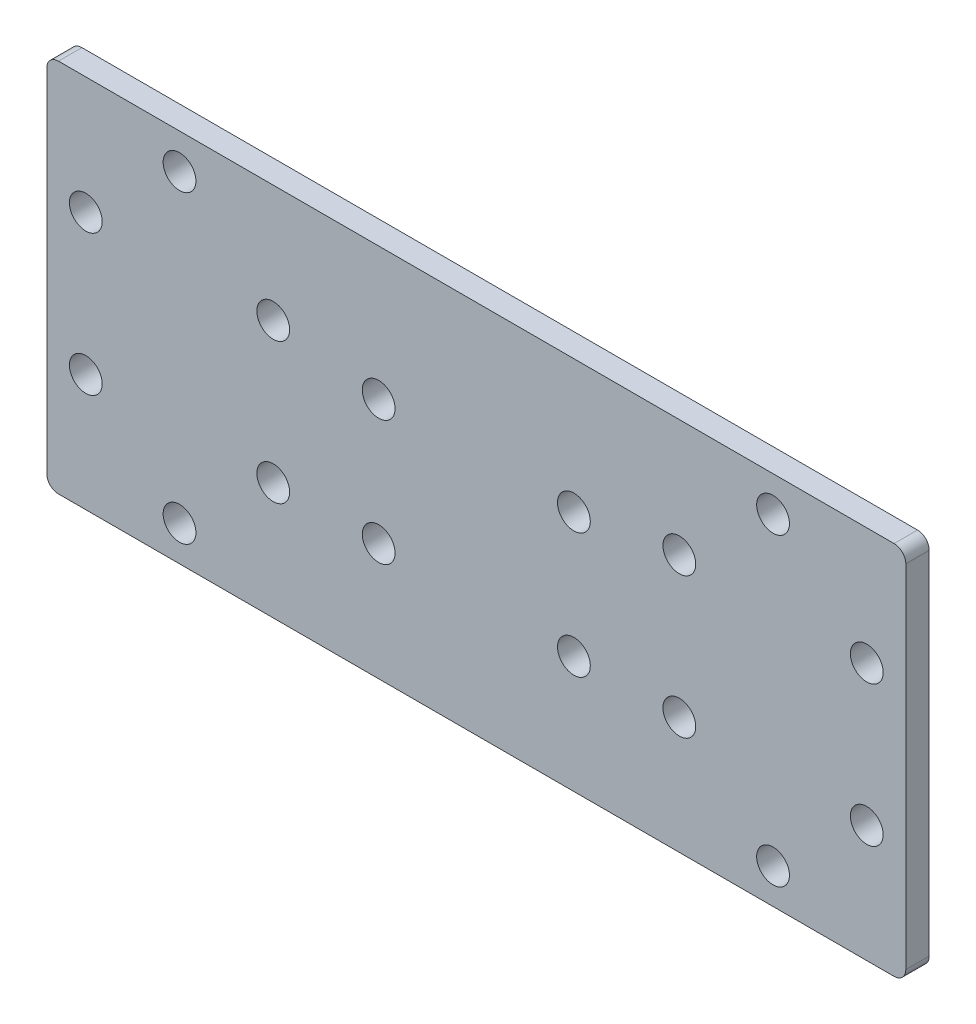
ISO-10303-21;
HEADER;
FILE_DESCRIPTION(('STEP AP214'),'2;1');
FILE_NAME('part.step','',(''),(''),'','','');
FILE_SCHEMA(('AUTOMOTIVE_DESIGN { 1 0 10303 214 1 1 1 1 }'));
ENDSEC;
DATA;
#1=APPLICATION_CONTEXT('core data for automotive mechanical design processes');
#2=APPLICATION_PROTOCOL_DEFINITION('international standard','automotive_design',2000,#1);
#3=PRODUCT_CONTEXT('',#1,'mechanical');
#4=PRODUCT('Part','Part','',(#3));
#5=PRODUCT_RELATED_PRODUCT_CATEGORY('part','',(#4));
#6=PRODUCT_DEFINITION_FORMATION('','',#4);
#7=PRODUCT_DEFINITION_CONTEXT('part definition',#1,'design');
#8=PRODUCT_DEFINITION('design','',#6,#7);
#9=PRODUCT_DEFINITION_SHAPE('','',#8);
#10=(LENGTH_UNIT() NAMED_UNIT(*) SI_UNIT(.MILLI.,.METRE.));
#11=(NAMED_UNIT(*) PLANE_ANGLE_UNIT() SI_UNIT($,.RADIAN.));
#12=(NAMED_UNIT(*) SI_UNIT($,.STERADIAN.) SOLID_ANGLE_UNIT());
#13=UNCERTAINTY_MEASURE_WITH_UNIT(LENGTH_MEASURE(1.E-05),#10,'distance_accuracy_value','');
#14=(GEOMETRIC_REPRESENTATION_CONTEXT(3) GLOBAL_UNCERTAINTY_ASSIGNED_CONTEXT((#13)) GLOBAL_UNIT_ASSIGNED_CONTEXT((#10,
#11,#12)) REPRESENTATION_CONTEXT('',''));
#15=CARTESIAN_POINT('',(0.,0.,0.));
#16=DIRECTION('',(0.,0.,1.));
#17=DIRECTION('',(1.,0.,0.));
#18=AXIS2_PLACEMENT_3D('',#15,#16,#17);
#19=CARTESIAN_POINT('',(0.,0.,1.5));
#20=DIRECTION('',(0.,0.,-1.));
#21=DIRECTION('',(-1.,0.,0.));
#22=AXIS2_PLACEMENT_3D('',#19,#20,#21);
#23=PLANE('',#22);
#24=DIRECTION('',(0.,-1.,0.));
#25=VECTOR('',#24,1.);
#26=CARTESIAN_POINT('',(-54.9999999999997,-24.0000000000009,1.5));
#27=LINE('',#26,#25);
#28=CARTESIAN_POINT('',(-54.9999999999997,22.4999999999991,1.5));
#29=VERTEX_POINT('',#28);
#30=CARTESIAN_POINT('',(-54.9999999999997,-22.5000000000009,1.5));
#31=VERTEX_POINT('',#30);
#32=EDGE_CURVE('E138',#29,#31,#27,.T.);
#33=ORIENTED_EDGE('',*,*,#32,.T.);
#34=CARTESIAN_POINT('',(-53.4999999999997,-22.5000000000009,1.5));
#35=DIRECTION('',(0.,0.,-1.));
#36=DIRECTION('',(-1.,0.,0.));
#37=AXIS2_PLACEMENT_3D('',#34,#35,#36);
#38=CIRCLE('',#37,1.5);
#39=CARTESIAN_POINT('',(-53.4999999999997,-24.0000000000009,1.5));
#40=VERTEX_POINT('',#39);
#41=EDGE_CURVE('E153',#31,#40,#38,.F.);
#42=ORIENTED_EDGE('',*,*,#41,.T.);
#43=DIRECTION('',(1.,0.,0.));
#44=VECTOR('',#43,1.);
#45=CARTESIAN_POINT('',(-54.9999999999997,-24.0000000000009,1.5));
#46=LINE('',#45,#44);
#47=CARTESIAN_POINT('',(53.4999999999988,-24.0000000000009,1.5));
#48=VERTEX_POINT('',#47);
#49=EDGE_CURVE('E120',#40,#48,#46,.T.);
#50=ORIENTED_EDGE('',*,*,#49,.T.);
#51=CARTESIAN_POINT('',(53.4999999999988,-22.5000000000009,1.5));
#52=DIRECTION('',(0.,0.,-1.));
#53=DIRECTION('',(-1.,0.,0.));
#54=AXIS2_PLACEMENT_3D('',#51,#52,#53);
#55=CIRCLE('',#54,1.5);
#56=CARTESIAN_POINT('',(54.9999999999988,-22.5000000000009,1.5));
#57=VERTEX_POINT('',#56);
#58=EDGE_CURVE('E151',#48,#57,#55,.F.);
#59=ORIENTED_EDGE('',*,*,#58,.T.);
#60=DIRECTION('',(0.,1.,0.));
#61=VECTOR('',#60,1.);
#62=CARTESIAN_POINT('',(54.9999999999988,23.9999999999991,1.5));
#63=LINE('',#62,#61);
#64=CARTESIAN_POINT('',(54.9999999999988,22.4999999999991,1.5));
#65=VERTEX_POINT('',#64);
#66=EDGE_CURVE('E164',#57,#65,#63,.T.);
#67=ORIENTED_EDGE('',*,*,#66,.T.);
#68=CARTESIAN_POINT('',(53.4999999999988,22.4999999999991,1.5));
#69=DIRECTION('',(0.,0.,-1.));
#70=DIRECTION('',(-1.,0.,0.));
#71=AXIS2_PLACEMENT_3D('',#68,#69,#70);
#72=CIRCLE('',#71,1.5);
#73=CARTESIAN_POINT('',(53.4999999999988,23.9999999999991,1.5));
#74=VERTEX_POINT('',#73);
#75=EDGE_CURVE('E55',#65,#74,#72,.F.);
#76=ORIENTED_EDGE('',*,*,#75,.T.);
#77=DIRECTION('',(-1.,0.,0.));
#78=VECTOR('',#77,1.);
#79=CARTESIAN_POINT('',(-54.9999999999997,23.9999999999991,1.5));
#80=LINE('',#79,#78);
#81=CARTESIAN_POINT('',(-53.4999999999997,23.9999999999991,1.5));
#82=VERTEX_POINT('',#81);
#83=EDGE_CURVE('E139',#74,#82,#80,.T.);
#84=ORIENTED_EDGE('',*,*,#83,.T.);
#85=CARTESIAN_POINT('',(-53.4999999999997,22.4999999999991,1.5));
#86=DIRECTION('',(0.,0.,-1.));
#87=DIRECTION('',(-1.,0.,0.));
#88=AXIS2_PLACEMENT_3D('',#85,#86,#87);
#89=CIRCLE('',#88,1.5);
#90=EDGE_CURVE('E148',#82,#29,#89,.F.);
#91=ORIENTED_EDGE('',*,*,#90,.T.);
#92=EDGE_LOOP('',(#33,#42,#50,#59,#67,#76,#84,#91));
#93=FACE_BOUND('',#92,.T.);
#94=CARTESIAN_POINT('',(49.999999999998,8.99999999999945,1.5));
#95=DIRECTION('',(0.,0.,1.));
#96=DIRECTION('',(1.,0.,0.));
#97=AXIS2_PLACEMENT_3D('',#94,#95,#96);
#98=CIRCLE('',#97,2.10000000000043);
#99=CARTESIAN_POINT('',(52.0999999999985,8.99999999999945,1.5));
#100=VERTEX_POINT('',#99);
#101=EDGE_CURVE('E133',#100,#100,#98,.T.);
#102=ORIENTED_EDGE('',*,*,#101,.F.);
#103=EDGE_LOOP('',(#102));
#104=FACE_BOUND('',#103,.T.);
#105=CARTESIAN_POINT('',(25.999999999998,8.99999999999945,1.5));
#106=DIRECTION('',(0.,0.,1.));
#107=DIRECTION('',(1.,0.,0.));
#108=AXIS2_PLACEMENT_3D('',#105,#106,#107);
#109=CIRCLE('',#108,2.10000000000044);
#110=CARTESIAN_POINT('',(28.0999999999985,8.99999999999945,1.5));
#111=VERTEX_POINT('',#110);
#112=EDGE_CURVE('E181',#111,#111,#109,.T.);
#113=ORIENTED_EDGE('',*,*,#112,.F.);
#114=EDGE_LOOP('',(#113));
#115=FACE_BOUND('',#114,.T.);
#116=CARTESIAN_POINT('',(49.999999999998,-9.00000000000034,1.5));
#117=DIRECTION('',(0.,0.,1.));
#118=DIRECTION('',(1.,0.,0.));
#119=AXIS2_PLACEMENT_3D('',#116,#117,#118);
#120=CIRCLE('',#119,2.10000000000043);
#121=CARTESIAN_POINT('',(52.0999999999985,-9.00000000000034,1.5));
#122=VERTEX_POINT('',#121);
#123=EDGE_CURVE('E187',#122,#122,#120,.T.);
#124=ORIENTED_EDGE('',*,*,#123,.F.);
#125=EDGE_LOOP('',(#124));
#126=FACE_BOUND('',#125,.T.);
#127=CARTESIAN_POINT('',(25.999999999998,-9.00000000000034,1.5));
#128=DIRECTION('',(0.,0.,1.));
#129=DIRECTION('',(1.,0.,0.));
#130=AXIS2_PLACEMENT_3D('',#127,#128,#129);
#131=CIRCLE('',#130,2.10000000000044);
#132=CARTESIAN_POINT('',(28.0999999999985,-9.00000000000034,1.5));
#133=VERTEX_POINT('',#132);
#134=EDGE_CURVE('E193',#133,#133,#131,.T.);
#135=ORIENTED_EDGE('',*,*,#134,.F.);
#136=EDGE_LOOP('',(#135));
#137=FACE_BOUND('',#136,.T.);
#138=CARTESIAN_POINT('',(-49.9999999999989,8.99999999999856,1.5));
#139=DIRECTION('',(0.,0.,1.));
#140=DIRECTION('',(1.,0.,0.));
#141=AXIS2_PLACEMENT_3D('',#138,#139,#140);
#142=CIRCLE('',#141,2.10000000000043);
#143=CARTESIAN_POINT('',(-47.8999999999985,8.99999999999856,1.5));
#144=VERTEX_POINT('',#143);
#145=EDGE_CURVE('E199',#144,#144,#142,.T.);
#146=ORIENTED_EDGE('',*,*,#145,.F.);
#147=EDGE_LOOP('',(#146));
#148=FACE_BOUND('',#147,.T.);
#149=CARTESIAN_POINT('',(-25.9999999999989,8.99999999999856,1.5));
#150=DIRECTION('',(0.,0.,1.));
#151=DIRECTION('',(1.,0.,0.));
#152=AXIS2_PLACEMENT_3D('',#149,#150,#151);
#153=CIRCLE('',#152,2.10000000000044);
#154=CARTESIAN_POINT('',(-23.8999999999985,8.99999999999856,1.5));
#155=VERTEX_POINT('',#154);
#156=EDGE_CURVE('E205',#155,#155,#153,.T.);
#157=ORIENTED_EDGE('',*,*,#156,.F.);
#158=EDGE_LOOP('',(#157));
#159=FACE_BOUND('',#158,.T.);
#160=CARTESIAN_POINT('',(-49.9999999999989,-9.00000000000123,1.5));
#161=DIRECTION('',(0.,0.,1.));
#162=DIRECTION('',(1.,0.,0.));
#163=AXIS2_PLACEMENT_3D('',#160,#161,#162);
#164=CIRCLE('',#163,2.10000000000043);
#165=CARTESIAN_POINT('',(-47.8999999999985,-9.00000000000123,1.5));
#166=VERTEX_POINT('',#165);
#167=EDGE_CURVE('E211',#166,#166,#164,.T.);
#168=ORIENTED_EDGE('',*,*,#167,.F.);
#169=EDGE_LOOP('',(#168));
#170=FACE_BOUND('',#169,.T.);
#171=CARTESIAN_POINT('',(-25.9999999999989,-9.00000000000034,1.5));
#172=DIRECTION('',(0.,0.,1.));
#173=DIRECTION('',(1.,0.,0.));
#174=AXIS2_PLACEMENT_3D('',#171,#172,#173);
#175=CIRCLE('',#174,2.10000000000044);
#176=CARTESIAN_POINT('',(-23.8999999999985,-9.00000000000034,1.5));
#177=VERTEX_POINT('',#176);
#178=EDGE_CURVE('E217',#177,#177,#175,.T.);
#179=ORIENTED_EDGE('',*,*,#178,.F.);
#180=EDGE_LOOP('',(#179));
#181=FACE_BOUND('',#180,.T.);
#182=CARTESIAN_POINT('',(-38.0000000000003,19.4999999999999,1.5));
#183=DIRECTION('',(0.,0.,1.));
#184=DIRECTION('',(1.,0.,0.));
#185=AXIS2_PLACEMENT_3D('',#182,#183,#184);
#186=CIRCLE('',#185,2.10000000000043);
#187=CARTESIAN_POINT('',(-35.8999999999998,19.4999999999999,1.5));
#188=VERTEX_POINT('',#187);
#189=EDGE_CURVE('E223',#188,#188,#186,.T.);
#190=ORIENTED_EDGE('',*,*,#189,.F.);
#191=EDGE_LOOP('',(#190));
#192=FACE_BOUND('',#191,.T.);
#193=CARTESIAN_POINT('',(-38.0000000000011,-19.5000000000025,1.5));
#194=DIRECTION('',(0.,0.,1.));
#195=DIRECTION('',(1.,0.,0.));
#196=AXIS2_PLACEMENT_3D('',#193,#194,#195);
#197=CIRCLE('',#196,2.10000000000043);
#198=CARTESIAN_POINT('',(-35.9000000000007,-19.5000000000025,1.5));
#199=VERTEX_POINT('',#198);
#200=EDGE_CURVE('E229',#199,#199,#197,.T.);
#201=ORIENTED_EDGE('',*,*,#200,.F.);
#202=EDGE_LOOP('',(#201));
#203=FACE_BOUND('',#202,.T.);
#204=CARTESIAN_POINT('',(38.0000000000003,19.4999999999999,1.5));
#205=DIRECTION('',(0.,0.,1.));
#206=DIRECTION('',(1.,0.,0.));
#207=AXIS2_PLACEMENT_3D('',#204,#205,#206);
#208=CIRCLE('',#207,2.10000000000043);
#209=CARTESIAN_POINT('',(40.1000000000007,19.4999999999999,1.5));
#210=VERTEX_POINT('',#209);
#211=EDGE_CURVE('E235',#210,#210,#208,.T.);
#212=ORIENTED_EDGE('',*,*,#211,.F.);
#213=EDGE_LOOP('',(#212));
#214=FACE_BOUND('',#213,.T.);
#215=CARTESIAN_POINT('',(38.0000000000011,-19.5000000000025,1.5));
#216=DIRECTION('',(0.,0.,1.));
#217=DIRECTION('',(1.,0.,0.));
#218=AXIS2_PLACEMENT_3D('',#215,#216,#217);
#219=CIRCLE('',#218,2.10000000000043);
#220=CARTESIAN_POINT('',(40.1000000000016,-19.5000000000025,1.5));
#221=VERTEX_POINT('',#220);
#222=EDGE_CURVE('E241',#221,#221,#219,.T.);
#223=ORIENTED_EDGE('',*,*,#222,.F.);
#224=EDGE_LOOP('',(#223));
#225=FACE_BOUND('',#224,.T.);
#226=CARTESIAN_POINT('',(12.4999999999993,-8.99999999999856,1.5));
#227=DIRECTION('',(0.,0.,1.));
#228=DIRECTION('',(1.,0.,0.));
#229=AXIS2_PLACEMENT_3D('',#226,#227,#228);
#230=CIRCLE('',#229,2.10000000000043);
#231=CARTESIAN_POINT('',(14.5999999999997,-8.99999999999856,1.5));
#232=VERTEX_POINT('',#231);
#233=EDGE_CURVE('E247',#232,#232,#230,.T.);
#234=ORIENTED_EDGE('',*,*,#233,.F.);
#235=EDGE_LOOP('',(#234));
#236=FACE_BOUND('',#235,.T.);
#237=CARTESIAN_POINT('',(-12.500000000002,-8.99999999999856,1.5));
#238=DIRECTION('',(0.,0.,1.));
#239=DIRECTION('',(1.,0.,0.));
#240=AXIS2_PLACEMENT_3D('',#237,#238,#239);
#241=CIRCLE('',#240,2.10000000000043);
#242=CARTESIAN_POINT('',(-10.4000000000015,-8.99999999999856,1.5));
#243=VERTEX_POINT('',#242);
#244=EDGE_CURVE('E253',#243,#243,#241,.T.);
#245=ORIENTED_EDGE('',*,*,#244,.F.);
#246=EDGE_LOOP('',(#245));
#247=FACE_BOUND('',#246,.T.);
#248=CARTESIAN_POINT('',(-12.500000000002,7.00000000000056,1.5));
#249=DIRECTION('',(0.,0.,1.));
#250=DIRECTION('',(1.,0.,0.));
#251=AXIS2_PLACEMENT_3D('',#248,#249,#250);
#252=CIRCLE('',#251,2.10000000000043);
#253=CARTESIAN_POINT('',(-10.4000000000015,7.00000000000056,1.5));
#254=VERTEX_POINT('',#253);
#255=EDGE_CURVE('E259',#254,#254,#252,.T.);
#256=ORIENTED_EDGE('',*,*,#255,.F.);
#257=EDGE_LOOP('',(#256));
#258=FACE_BOUND('',#257,.T.);
#259=CARTESIAN_POINT('',(12.4999999999993,7.00000000000145,1.5));
#260=DIRECTION('',(0.,0.,1.));
#261=DIRECTION('',(1.,0.,0.));
#262=AXIS2_PLACEMENT_3D('',#259,#260,#261);
#263=CIRCLE('',#262,2.10000000000043);
#264=CARTESIAN_POINT('',(14.5999999999997,7.00000000000145,1.5));
#265=VERTEX_POINT('',#264);
#266=EDGE_CURVE('E265',#265,#265,#263,.T.);
#267=ORIENTED_EDGE('',*,*,#266,.F.);
#268=EDGE_LOOP('',(#267));
#269=FACE_BOUND('',#268,.T.);
#270=ADVANCED_FACE('F34',(#93,#104,#115,#126,#137,#148,#159,#170,#181,#192,#203,#214,#225,#236,
#247,#258,#269),#23,.F.);
#271=CARTESIAN_POINT('',(0.,0.,-1.5));
#272=DIRECTION('',(0.,0.,-1.));
#273=DIRECTION('',(-1.,0.,0.));
#274=AXIS2_PLACEMENT_3D('',#271,#272,#273);
#275=PLANE('',#274);
#276=CARTESIAN_POINT('',(-12.500000000002,7.00000000000056,-1.5));
#277=DIRECTION('',(0.,0.,1.));
#278=DIRECTION('',(1.,0.,0.));
#279=AXIS2_PLACEMENT_3D('',#276,#277,#278);
#280=CIRCLE('',#279,2.10000000000043);
#281=CARTESIAN_POINT('',(-10.4000000000015,7.00000000000056,-1.5));
#282=VERTEX_POINT('',#281);
#283=EDGE_CURVE('E262',#282,#282,#280,.T.);
#284=ORIENTED_EDGE('',*,*,#283,.T.);
#285=EDGE_LOOP('',(#284));
#286=FACE_BOUND('',#285,.T.);
#287=CARTESIAN_POINT('',(12.4999999999993,-8.99999999999856,-1.5));
#288=DIRECTION('',(0.,0.,1.));
#289=DIRECTION('',(1.,0.,0.));
#290=AXIS2_PLACEMENT_3D('',#287,#288,#289);
#291=CIRCLE('',#290,2.10000000000043);
#292=CARTESIAN_POINT('',(14.5999999999997,-8.99999999999856,-1.5));
#293=VERTEX_POINT('',#292);
#294=EDGE_CURVE('E250',#293,#293,#291,.T.);
#295=ORIENTED_EDGE('',*,*,#294,.T.);
#296=EDGE_LOOP('',(#295));
#297=FACE_BOUND('',#296,.T.);
#298=CARTESIAN_POINT('',(38.0000000000003,19.4999999999999,-1.5));
#299=DIRECTION('',(0.,0.,1.));
#300=DIRECTION('',(1.,0.,0.));
#301=AXIS2_PLACEMENT_3D('',#298,#299,#300);
#302=CIRCLE('',#301,2.10000000000043);
#303=CARTESIAN_POINT('',(40.1000000000007,19.4999999999999,-1.5));
#304=VERTEX_POINT('',#303);
#305=EDGE_CURVE('E238',#304,#304,#302,.T.);
#306=ORIENTED_EDGE('',*,*,#305,.T.);
#307=EDGE_LOOP('',(#306));
#308=FACE_BOUND('',#307,.T.);
#309=CARTESIAN_POINT('',(-38.0000000000003,19.4999999999999,-1.5));
#310=DIRECTION('',(0.,0.,1.));
#311=DIRECTION('',(1.,0.,0.));
#312=AXIS2_PLACEMENT_3D('',#309,#310,#311);
#313=CIRCLE('',#312,2.10000000000043);
#314=CARTESIAN_POINT('',(-35.8999999999998,19.4999999999999,-1.5));
#315=VERTEX_POINT('',#314);
#316=EDGE_CURVE('E226',#315,#315,#313,.T.);
#317=ORIENTED_EDGE('',*,*,#316,.T.);
#318=EDGE_LOOP('',(#317));
#319=FACE_BOUND('',#318,.T.);
#320=CARTESIAN_POINT('',(-49.9999999999989,-9.00000000000123,-1.5));
#321=DIRECTION('',(0.,0.,1.));
#322=DIRECTION('',(1.,0.,0.));
#323=AXIS2_PLACEMENT_3D('',#320,#321,#322);
#324=CIRCLE('',#323,2.10000000000043);
#325=CARTESIAN_POINT('',(-47.8999999999985,-9.00000000000123,-1.5));
#326=VERTEX_POINT('',#325);
#327=EDGE_CURVE('E214',#326,#326,#324,.T.);
#328=ORIENTED_EDGE('',*,*,#327,.T.);
#329=EDGE_LOOP('',(#328));
#330=FACE_BOUND('',#329,.T.);
#331=CARTESIAN_POINT('',(-49.9999999999989,8.99999999999856,-1.5));
#332=DIRECTION('',(0.,0.,1.));
#333=DIRECTION('',(1.,0.,0.));
#334=AXIS2_PLACEMENT_3D('',#331,#332,#333);
#335=CIRCLE('',#334,2.10000000000043);
#336=CARTESIAN_POINT('',(-47.8999999999985,8.99999999999856,-1.5));
#337=VERTEX_POINT('',#336);
#338=EDGE_CURVE('E202',#337,#337,#335,.T.);
#339=ORIENTED_EDGE('',*,*,#338,.T.);
#340=EDGE_LOOP('',(#339));
#341=FACE_BOUND('',#340,.T.);
#342=CARTESIAN_POINT('',(49.999999999998,-9.00000000000034,-1.5));
#343=DIRECTION('',(0.,0.,1.));
#344=DIRECTION('',(1.,0.,0.));
#345=AXIS2_PLACEMENT_3D('',#342,#343,#344);
#346=CIRCLE('',#345,2.10000000000043);
#347=CARTESIAN_POINT('',(52.0999999999985,-9.00000000000034,-1.5));
#348=VERTEX_POINT('',#347);
#349=EDGE_CURVE('E190',#348,#348,#346,.T.);
#350=ORIENTED_EDGE('',*,*,#349,.T.);
#351=EDGE_LOOP('',(#350));
#352=FACE_BOUND('',#351,.T.);
#353=CARTESIAN_POINT('',(49.999999999998,8.99999999999945,-1.5));
#354=DIRECTION('',(0.,0.,1.));
#355=DIRECTION('',(1.,0.,0.));
#356=AXIS2_PLACEMENT_3D('',#353,#354,#355);
#357=CIRCLE('',#356,2.10000000000043);
#358=CARTESIAN_POINT('',(52.0999999999985,8.99999999999945,-1.5));
#359=VERTEX_POINT('',#358);
#360=EDGE_CURVE('E178',#359,#359,#357,.T.);
#361=ORIENTED_EDGE('',*,*,#360,.T.);
#362=EDGE_LOOP('',(#361));
#363=FACE_BOUND('',#362,.T.);
#364=DIRECTION('',(1.,0.,0.));
#365=VECTOR('',#364,1.);
#366=CARTESIAN_POINT('',(-54.9999999999997,-24.0000000000009,-1.5));
#367=LINE('',#366,#365);
#368=CARTESIAN_POINT('',(-53.4999999999997,-24.0000000000009,-1.5));
#369=VERTEX_POINT('',#368);
#370=CARTESIAN_POINT('',(53.4999999999988,-24.0000000000009,-1.5));
#371=VERTEX_POINT('',#370);
#372=EDGE_CURVE('E117',#369,#371,#367,.T.);
#373=ORIENTED_EDGE('',*,*,#372,.F.);
#374=CARTESIAN_POINT('',(-53.4999999999997,-22.5000000000009,-1.5));
#375=DIRECTION('',(0.,0.,-1.));
#376=DIRECTION('',(-1.,0.,0.));
#377=AXIS2_PLACEMENT_3D('',#374,#375,#376);
#378=CIRCLE('',#377,1.5);
#379=CARTESIAN_POINT('',(-54.9999999999997,-22.5000000000009,-1.5));
#380=VERTEX_POINT('',#379);
#381=EDGE_CURVE('E100',#369,#380,#378,.T.);
#382=ORIENTED_EDGE('',*,*,#381,.T.);
#383=DIRECTION('',(0.,-1.,0.));
#384=VECTOR('',#383,1.);
#385=CARTESIAN_POINT('',(-54.9999999999997,-24.0000000000009,-1.5));
#386=LINE('',#385,#384);
#387=CARTESIAN_POINT('',(-54.9999999999997,22.4999999999991,-1.5));
#388=VERTEX_POINT('',#387);
#389=EDGE_CURVE('E128',#388,#380,#386,.T.);
#390=ORIENTED_EDGE('',*,*,#389,.F.);
#391=CARTESIAN_POINT('',(-53.4999999999997,22.4999999999991,-1.5));
#392=DIRECTION('',(0.,0.,-1.));
#393=DIRECTION('',(-1.,0.,0.));
#394=AXIS2_PLACEMENT_3D('',#391,#392,#393);
#395=CIRCLE('',#394,1.5);
#396=CARTESIAN_POINT('',(-53.4999999999997,23.9999999999991,-1.5));
#397=VERTEX_POINT('',#396);
#398=EDGE_CURVE('E121',#388,#397,#395,.T.);
#399=ORIENTED_EDGE('',*,*,#398,.T.);
#400=DIRECTION('',(-1.,0.,0.));
#401=VECTOR('',#400,1.);
#402=CARTESIAN_POINT('',(-54.9999999999997,23.9999999999991,-1.5));
#403=LINE('',#402,#401);
#404=CARTESIAN_POINT('',(53.4999999999988,23.9999999999991,-1.5));
#405=VERTEX_POINT('',#404);
#406=EDGE_CURVE('E131',#405,#397,#403,.T.);
#407=ORIENTED_EDGE('',*,*,#406,.F.);
#408=CARTESIAN_POINT('',(53.4999999999988,22.4999999999991,-1.5));
#409=DIRECTION('',(0.,0.,-1.));
#410=DIRECTION('',(-1.,0.,0.));
#411=AXIS2_PLACEMENT_3D('',#408,#409,#410);
#412=CIRCLE('',#411,1.5);
#413=CARTESIAN_POINT('',(54.9999999999988,22.4999999999991,-1.5));
#414=VERTEX_POINT('',#413);
#415=EDGE_CURVE('E142',#405,#414,#412,.T.);
#416=ORIENTED_EDGE('',*,*,#415,.T.);
#417=DIRECTION('',(0.,1.,0.));
#418=VECTOR('',#417,1.);
#419=CARTESIAN_POINT('',(54.9999999999988,23.9999999999991,-1.5));
#420=LINE('',#419,#418);
#421=CARTESIAN_POINT('',(54.9999999999988,-22.5000000000009,-1.5));
#422=VERTEX_POINT('',#421);
#423=EDGE_CURVE('E127',#422,#414,#420,.T.);
#424=ORIENTED_EDGE('',*,*,#423,.F.);
#425=CARTESIAN_POINT('',(53.4999999999988,-22.5000000000009,-1.5));
#426=DIRECTION('',(0.,0.,-1.));
#427=DIRECTION('',(-1.,0.,0.));
#428=AXIS2_PLACEMENT_3D('',#425,#426,#427);
#429=CIRCLE('',#428,1.5);
#430=EDGE_CURVE('E111',#422,#371,#429,.T.);
#431=ORIENTED_EDGE('',*,*,#430,.T.);
#432=EDGE_LOOP('',(#373,#382,#390,#399,#407,#416,#424,#431));
#433=FACE_BOUND('',#432,.T.);
#434=CARTESIAN_POINT('',(25.999999999998,8.99999999999945,-1.5));
#435=DIRECTION('',(0.,0.,1.));
#436=DIRECTION('',(1.,0.,0.));
#437=AXIS2_PLACEMENT_3D('',#434,#435,#436);
#438=CIRCLE('',#437,2.10000000000044);
#439=CARTESIAN_POINT('',(28.0999999999985,8.99999999999945,-1.5));
#440=VERTEX_POINT('',#439);
#441=EDGE_CURVE('E184',#440,#440,#438,.T.);
#442=ORIENTED_EDGE('',*,*,#441,.T.);
#443=EDGE_LOOP('',(#442));
#444=FACE_BOUND('',#443,.T.);
#445=CARTESIAN_POINT('',(25.999999999998,-9.00000000000034,-1.5));
#446=DIRECTION('',(0.,0.,1.));
#447=DIRECTION('',(1.,0.,0.));
#448=AXIS2_PLACEMENT_3D('',#445,#446,#447);
#449=CIRCLE('',#448,2.10000000000044);
#450=CARTESIAN_POINT('',(28.0999999999985,-9.00000000000034,-1.5));
#451=VERTEX_POINT('',#450);
#452=EDGE_CURVE('E196',#451,#451,#449,.T.);
#453=ORIENTED_EDGE('',*,*,#452,.T.);
#454=EDGE_LOOP('',(#453));
#455=FACE_BOUND('',#454,.T.);
#456=CARTESIAN_POINT('',(-25.9999999999989,8.99999999999856,-1.5));
#457=DIRECTION('',(0.,0.,1.));
#458=DIRECTION('',(1.,0.,0.));
#459=AXIS2_PLACEMENT_3D('',#456,#457,#458);
#460=CIRCLE('',#459,2.10000000000044);
#461=CARTESIAN_POINT('',(-23.8999999999985,8.99999999999856,-1.5));
#462=VERTEX_POINT('',#461);
#463=EDGE_CURVE('E208',#462,#462,#460,.T.);
#464=ORIENTED_EDGE('',*,*,#463,.T.);
#465=EDGE_LOOP('',(#464));
#466=FACE_BOUND('',#465,.T.);
#467=CARTESIAN_POINT('',(-25.9999999999989,-9.00000000000034,-1.5));
#468=DIRECTION('',(0.,0.,1.));
#469=DIRECTION('',(1.,0.,0.));
#470=AXIS2_PLACEMENT_3D('',#467,#468,#469);
#471=CIRCLE('',#470,2.10000000000044);
#472=CARTESIAN_POINT('',(-23.8999999999985,-9.00000000000034,-1.5));
#473=VERTEX_POINT('',#472);
#474=EDGE_CURVE('E220',#473,#473,#471,.T.);
#475=ORIENTED_EDGE('',*,*,#474,.T.);
#476=EDGE_LOOP('',(#475));
#477=FACE_BOUND('',#476,.T.);
#478=CARTESIAN_POINT('',(-38.0000000000011,-19.5000000000025,-1.5));
#479=DIRECTION('',(0.,0.,1.));
#480=DIRECTION('',(1.,0.,0.));
#481=AXIS2_PLACEMENT_3D('',#478,#479,#480);
#482=CIRCLE('',#481,2.10000000000043);
#483=CARTESIAN_POINT('',(-35.9000000000007,-19.5000000000025,-1.5));
#484=VERTEX_POINT('',#483);
#485=EDGE_CURVE('E232',#484,#484,#482,.T.);
#486=ORIENTED_EDGE('',*,*,#485,.T.);
#487=EDGE_LOOP('',(#486));
#488=FACE_BOUND('',#487,.T.);
#489=CARTESIAN_POINT('',(38.0000000000011,-19.5000000000025,-1.5));
#490=DIRECTION('',(0.,0.,1.));
#491=DIRECTION('',(1.,0.,0.));
#492=AXIS2_PLACEMENT_3D('',#489,#490,#491);
#493=CIRCLE('',#492,2.10000000000043);
#494=CARTESIAN_POINT('',(40.1000000000016,-19.5000000000025,-1.5));
#495=VERTEX_POINT('',#494);
#496=EDGE_CURVE('E244',#495,#495,#493,.T.);
#497=ORIENTED_EDGE('',*,*,#496,.T.);
#498=EDGE_LOOP('',(#497));
#499=FACE_BOUND('',#498,.T.);
#500=CARTESIAN_POINT('',(-12.500000000002,-8.99999999999856,-1.5));
#501=DIRECTION('',(0.,0.,1.));
#502=DIRECTION('',(1.,0.,0.));
#503=AXIS2_PLACEMENT_3D('',#500,#501,#502);
#504=CIRCLE('',#503,2.10000000000043);
#505=CARTESIAN_POINT('',(-10.4000000000015,-8.99999999999856,-1.5));
#506=VERTEX_POINT('',#505);
#507=EDGE_CURVE('E256',#506,#506,#504,.T.);
#508=ORIENTED_EDGE('',*,*,#507,.T.);
#509=EDGE_LOOP('',(#508));
#510=FACE_BOUND('',#509,.T.);
#511=CARTESIAN_POINT('',(12.4999999999993,7.00000000000145,-1.5));
#512=DIRECTION('',(0.,0.,1.));
#513=DIRECTION('',(1.,0.,0.));
#514=AXIS2_PLACEMENT_3D('',#511,#512,#513);
#515=CIRCLE('',#514,2.10000000000043);
#516=CARTESIAN_POINT('',(14.5999999999997,7.00000000000145,-1.5));
#517=VERTEX_POINT('',#516);
#518=EDGE_CURVE('E268',#517,#517,#515,.T.);
#519=ORIENTED_EDGE('',*,*,#518,.T.);
#520=EDGE_LOOP('',(#519));
#521=FACE_BOUND('',#520,.T.);
#522=ADVANCED_FACE('F124',(#286,#297,#308,#319,#330,#341,#352,#363,#433,#444,#455,#466,#477,
#488,#499,#510,#521),#275,.T.);
#523=CARTESIAN_POINT('',(-54.9999999999997,-24.0000000000009,1.5));
#524=DIRECTION('',(1.,0.,0.));
#525=DIRECTION('',(0.,0.,-1.));
#526=AXIS2_PLACEMENT_3D('',#523,#524,#525);
#527=PLANE('',#526);
#528=ORIENTED_EDGE('',*,*,#389,.T.);
#529=DIRECTION('',(0.,0.,-1.));
#530=VECTOR('',#529,1.);
#531=CARTESIAN_POINT('',(-54.9999999999997,-22.5000000000009,1.5));
#532=LINE('',#531,#530);
#533=EDGE_CURVE('E105',#380,#31,#532,.F.);
#534=ORIENTED_EDGE('',*,*,#533,.T.);
#535=ORIENTED_EDGE('',*,*,#32,.F.);
#536=DIRECTION('',(0.,0.,-1.));
#537=VECTOR('',#536,1.);
#538=CARTESIAN_POINT('',(-54.9999999999997,22.4999999999991,1.5));
#539=LINE('',#538,#537);
#540=EDGE_CURVE('E110',#29,#388,#539,.T.);
#541=ORIENTED_EDGE('',*,*,#540,.T.);
#542=EDGE_LOOP('',(#528,#534,#535,#541));
#543=FACE_BOUND('',#542,.T.);
#544=ADVANCED_FACE('F282',(#543),#527,.F.);
#545=CARTESIAN_POINT('',(-54.9999999999997,-24.0000000000009,1.5));
#546=DIRECTION('',(0.,1.,0.));
#547=DIRECTION('',(0.,0.,1.));
#548=AXIS2_PLACEMENT_3D('',#545,#546,#547);
#549=PLANE('',#548);
#550=ORIENTED_EDGE('',*,*,#49,.F.);
#551=DIRECTION('',(0.,0.,-1.));
#552=VECTOR('',#551,1.);
#553=CARTESIAN_POINT('',(-53.4999999999997,-24.0000000000009,1.5));
#554=LINE('',#553,#552);
#555=EDGE_CURVE('E104',#40,#369,#554,.T.);
#556=ORIENTED_EDGE('',*,*,#555,.T.);
#557=ORIENTED_EDGE('',*,*,#372,.T.);
#558=DIRECTION('',(0.,0.,-1.));
#559=VECTOR('',#558,1.);
#560=CARTESIAN_POINT('',(53.4999999999988,-24.0000000000009,1.5));
#561=LINE('',#560,#559);
#562=EDGE_CURVE('E122',#371,#48,#561,.F.);
#563=ORIENTED_EDGE('',*,*,#562,.T.);
#564=EDGE_LOOP('',(#550,#556,#557,#563));
#565=FACE_BOUND('',#564,.T.);
#566=ADVANCED_FACE('F116',(#565),#549,.F.);
#567=CARTESIAN_POINT('',(54.9999999999988,23.9999999999991,1.5));
#568=DIRECTION('',(-1.,0.,0.));
#569=DIRECTION('',(0.,0.,1.));
#570=AXIS2_PLACEMENT_3D('',#567,#568,#569);
#571=PLANE('',#570);
#572=ORIENTED_EDGE('',*,*,#66,.F.);
#573=DIRECTION('',(0.,0.,-1.));
#574=VECTOR('',#573,1.);
#575=CARTESIAN_POINT('',(54.9999999999988,-22.5000000000009,1.5));
#576=LINE('',#575,#574);
#577=EDGE_CURVE('E157',#57,#422,#576,.T.);
#578=ORIENTED_EDGE('',*,*,#577,.T.);
#579=ORIENTED_EDGE('',*,*,#423,.T.);
#580=DIRECTION('',(0.,0.,-1.));
#581=VECTOR('',#580,1.);
#582=CARTESIAN_POINT('',(54.9999999999988,22.4999999999991,1.5));
#583=LINE('',#582,#581);
#584=EDGE_CURVE('E155',#414,#65,#583,.F.);
#585=ORIENTED_EDGE('',*,*,#584,.T.);
#586=EDGE_LOOP('',(#572,#578,#579,#585));
#587=FACE_BOUND('',#586,.T.);
#588=ADVANCED_FACE('F162',(#587),#571,.F.);
#589=CARTESIAN_POINT('',(-54.9999999999997,23.9999999999991,1.5));
#590=DIRECTION('',(0.,-1.,0.));
#591=DIRECTION('',(0.,0.,-1.));
#592=AXIS2_PLACEMENT_3D('',#589,#590,#591);
#593=PLANE('',#592);
#594=ORIENTED_EDGE('',*,*,#83,.F.);
#595=DIRECTION('',(0.,0.,-1.));
#596=VECTOR('',#595,1.);
#597=CARTESIAN_POINT('',(53.4999999999988,23.9999999999991,1.5));
#598=LINE('',#597,#596);
#599=EDGE_CURVE('E11',#74,#405,#598,.T.);
#600=ORIENTED_EDGE('',*,*,#599,.T.);
#601=ORIENTED_EDGE('',*,*,#406,.T.);
#602=DIRECTION('',(0.,0.,-1.));
#603=VECTOR('',#602,1.);
#604=CARTESIAN_POINT('',(-53.4999999999997,23.9999999999991,1.5));
#605=LINE('',#604,#603);
#606=EDGE_CURVE('E42',#397,#82,#605,.F.);
#607=ORIENTED_EDGE('',*,*,#606,.T.);
#608=EDGE_LOOP('',(#594,#600,#601,#607));
#609=FACE_BOUND('',#608,.T.);
#610=ADVANCED_FACE('F171',(#609),#593,.F.);
#611=CARTESIAN_POINT('',(49.999999999998,8.99999999999945,1.5));
#612=DIRECTION('',(0.,0.,-1.));
#613=DIRECTION('',(-1.,0.,0.));
#614=AXIS2_PLACEMENT_3D('',#611,#612,#613);
#615=CYLINDRICAL_SURFACE('',#614,2.10000000000043);
#616=ORIENTED_EDGE('',*,*,#101,.T.);
#617=EDGE_LOOP('',(#616));
#618=FACE_BOUND('',#617,.T.);
#619=ORIENTED_EDGE('',*,*,#360,.F.);
#620=EDGE_LOOP('',(#619));
#621=FACE_BOUND('',#620,.T.);
#622=ADVANCED_FACE('F287',(#618,#621),#615,.F.);
#623=CARTESIAN_POINT('',(25.999999999998,8.99999999999945,1.5));
#624=DIRECTION('',(0.,0.,-1.));
#625=DIRECTION('',(-1.,0.,0.));
#626=AXIS2_PLACEMENT_3D('',#623,#624,#625);
#627=CYLINDRICAL_SURFACE('',#626,2.10000000000044);
#628=ORIENTED_EDGE('',*,*,#112,.T.);
#629=EDGE_LOOP('',(#628));
#630=FACE_BOUND('',#629,.T.);
#631=ORIENTED_EDGE('',*,*,#441,.F.);
#632=EDGE_LOOP('',(#631));
#633=FACE_BOUND('',#632,.T.);
#634=ADVANCED_FACE('F504',(#630,#633),#627,.F.);
#635=CARTESIAN_POINT('',(49.999999999998,-9.00000000000034,1.5));
#636=DIRECTION('',(0.,0.,-1.));
#637=DIRECTION('',(-1.,0.,0.));
#638=AXIS2_PLACEMENT_3D('',#635,#636,#637);
#639=CYLINDRICAL_SURFACE('',#638,2.10000000000043);
#640=ORIENTED_EDGE('',*,*,#123,.T.);
#641=EDGE_LOOP('',(#640));
#642=FACE_BOUND('',#641,.T.);
#643=ORIENTED_EDGE('',*,*,#349,.F.);
#644=EDGE_LOOP('',(#643));
#645=FACE_BOUND('',#644,.T.);
#646=ADVANCED_FACE('F494',(#642,#645),#639,.F.);
#647=CARTESIAN_POINT('',(25.999999999998,-9.00000000000034,1.5));
#648=DIRECTION('',(0.,0.,-1.));
#649=DIRECTION('',(-1.,0.,0.));
#650=AXIS2_PLACEMENT_3D('',#647,#648,#649);
#651=CYLINDRICAL_SURFACE('',#650,2.10000000000044);
#652=ORIENTED_EDGE('',*,*,#134,.T.);
#653=EDGE_LOOP('',(#652));
#654=FACE_BOUND('',#653,.T.);
#655=ORIENTED_EDGE('',*,*,#452,.F.);
#656=EDGE_LOOP('',(#655));
#657=FACE_BOUND('',#656,.T.);
#658=ADVANCED_FACE('F484',(#654,#657),#651,.F.);
#659=CARTESIAN_POINT('',(-49.9999999999989,8.99999999999856,1.5));
#660=DIRECTION('',(0.,0.,-1.));
#661=DIRECTION('',(-1.,0.,0.));
#662=AXIS2_PLACEMENT_3D('',#659,#660,#661);
#663=CYLINDRICAL_SURFACE('',#662,2.10000000000043);
#664=ORIENTED_EDGE('',*,*,#145,.T.);
#665=EDGE_LOOP('',(#664));
#666=FACE_BOUND('',#665,.T.);
#667=ORIENTED_EDGE('',*,*,#338,.F.);
#668=EDGE_LOOP('',(#667));
#669=FACE_BOUND('',#668,.T.);
#670=ADVANCED_FACE('F474',(#666,#669),#663,.F.);
#671=CARTESIAN_POINT('',(-25.9999999999989,8.99999999999856,1.5));
#672=DIRECTION('',(0.,0.,-1.));
#673=DIRECTION('',(-1.,0.,0.));
#674=AXIS2_PLACEMENT_3D('',#671,#672,#673);
#675=CYLINDRICAL_SURFACE('',#674,2.10000000000044);
#676=ORIENTED_EDGE('',*,*,#156,.T.);
#677=EDGE_LOOP('',(#676));
#678=FACE_BOUND('',#677,.T.);
#679=ORIENTED_EDGE('',*,*,#463,.F.);
#680=EDGE_LOOP('',(#679));
#681=FACE_BOUND('',#680,.T.);
#682=ADVANCED_FACE('F464',(#678,#681),#675,.F.);
#683=CARTESIAN_POINT('',(-49.9999999999989,-9.00000000000123,1.5));
#684=DIRECTION('',(0.,0.,-1.));
#685=DIRECTION('',(-1.,0.,0.));
#686=AXIS2_PLACEMENT_3D('',#683,#684,#685);
#687=CYLINDRICAL_SURFACE('',#686,2.10000000000043);
#688=ORIENTED_EDGE('',*,*,#167,.T.);
#689=EDGE_LOOP('',(#688));
#690=FACE_BOUND('',#689,.T.);
#691=ORIENTED_EDGE('',*,*,#327,.F.);
#692=EDGE_LOOP('',(#691));
#693=FACE_BOUND('',#692,.T.);
#694=ADVANCED_FACE('F454',(#690,#693),#687,.F.);
#695=CARTESIAN_POINT('',(-25.9999999999989,-9.00000000000034,1.5));
#696=DIRECTION('',(0.,0.,-1.));
#697=DIRECTION('',(-1.,0.,0.));
#698=AXIS2_PLACEMENT_3D('',#695,#696,#697);
#699=CYLINDRICAL_SURFACE('',#698,2.10000000000044);
#700=ORIENTED_EDGE('',*,*,#178,.T.);
#701=EDGE_LOOP('',(#700));
#702=FACE_BOUND('',#701,.T.);
#703=ORIENTED_EDGE('',*,*,#474,.F.);
#704=EDGE_LOOP('',(#703));
#705=FACE_BOUND('',#704,.T.);
#706=ADVANCED_FACE('F444',(#702,#705),#699,.F.);
#707=CARTESIAN_POINT('',(-38.0000000000003,19.4999999999999,1.5));
#708=DIRECTION('',(0.,0.,-1.));
#709=DIRECTION('',(-1.,0.,0.));
#710=AXIS2_PLACEMENT_3D('',#707,#708,#709);
#711=CYLINDRICAL_SURFACE('',#710,2.10000000000043);
#712=ORIENTED_EDGE('',*,*,#189,.T.);
#713=EDGE_LOOP('',(#712));
#714=FACE_BOUND('',#713,.T.);
#715=ORIENTED_EDGE('',*,*,#316,.F.);
#716=EDGE_LOOP('',(#715));
#717=FACE_BOUND('',#716,.T.);
#718=ADVANCED_FACE('F434',(#714,#717),#711,.F.);
#719=CARTESIAN_POINT('',(-38.0000000000011,-19.5000000000025,1.5));
#720=DIRECTION('',(0.,0.,-1.));
#721=DIRECTION('',(-1.,0.,0.));
#722=AXIS2_PLACEMENT_3D('',#719,#720,#721);
#723=CYLINDRICAL_SURFACE('',#722,2.10000000000043);
#724=ORIENTED_EDGE('',*,*,#200,.T.);
#725=EDGE_LOOP('',(#724));
#726=FACE_BOUND('',#725,.T.);
#727=ORIENTED_EDGE('',*,*,#485,.F.);
#728=EDGE_LOOP('',(#727));
#729=FACE_BOUND('',#728,.T.);
#730=ADVANCED_FACE('F424',(#726,#729),#723,.F.);
#731=CARTESIAN_POINT('',(38.0000000000003,19.4999999999999,1.5));
#732=DIRECTION('',(0.,0.,-1.));
#733=DIRECTION('',(-1.,0.,0.));
#734=AXIS2_PLACEMENT_3D('',#731,#732,#733);
#735=CYLINDRICAL_SURFACE('',#734,2.10000000000043);
#736=ORIENTED_EDGE('',*,*,#211,.T.);
#737=EDGE_LOOP('',(#736));
#738=FACE_BOUND('',#737,.T.);
#739=ORIENTED_EDGE('',*,*,#305,.F.);
#740=EDGE_LOOP('',(#739));
#741=FACE_BOUND('',#740,.T.);
#742=ADVANCED_FACE('F414',(#738,#741),#735,.F.);
#743=CARTESIAN_POINT('',(38.0000000000011,-19.5000000000025,1.5));
#744=DIRECTION('',(0.,0.,-1.));
#745=DIRECTION('',(-1.,0.,0.));
#746=AXIS2_PLACEMENT_3D('',#743,#744,#745);
#747=CYLINDRICAL_SURFACE('',#746,2.10000000000043);
#748=ORIENTED_EDGE('',*,*,#222,.T.);
#749=EDGE_LOOP('',(#748));
#750=FACE_BOUND('',#749,.T.);
#751=ORIENTED_EDGE('',*,*,#496,.F.);
#752=EDGE_LOOP('',(#751));
#753=FACE_BOUND('',#752,.T.);
#754=ADVANCED_FACE('F404',(#750,#753),#747,.F.);
#755=CARTESIAN_POINT('',(12.4999999999993,-8.99999999999856,1.5));
#756=DIRECTION('',(0.,0.,-1.));
#757=DIRECTION('',(-1.,0.,0.));
#758=AXIS2_PLACEMENT_3D('',#755,#756,#757);
#759=CYLINDRICAL_SURFACE('',#758,2.10000000000043);
#760=ORIENTED_EDGE('',*,*,#233,.T.);
#761=EDGE_LOOP('',(#760));
#762=FACE_BOUND('',#761,.T.);
#763=ORIENTED_EDGE('',*,*,#294,.F.);
#764=EDGE_LOOP('',(#763));
#765=FACE_BOUND('',#764,.T.);
#766=ADVANCED_FACE('F394',(#762,#765),#759,.F.);
#767=CARTESIAN_POINT('',(-12.500000000002,-8.99999999999856,1.5));
#768=DIRECTION('',(0.,0.,-1.));
#769=DIRECTION('',(-1.,0.,0.));
#770=AXIS2_PLACEMENT_3D('',#767,#768,#769);
#771=CYLINDRICAL_SURFACE('',#770,2.10000000000043);
#772=ORIENTED_EDGE('',*,*,#244,.T.);
#773=EDGE_LOOP('',(#772));
#774=FACE_BOUND('',#773,.T.);
#775=ORIENTED_EDGE('',*,*,#507,.F.);
#776=EDGE_LOOP('',(#775));
#777=FACE_BOUND('',#776,.T.);
#778=ADVANCED_FACE('F384',(#774,#777),#771,.F.);
#779=CARTESIAN_POINT('',(-12.500000000002,7.00000000000056,1.5));
#780=DIRECTION('',(0.,0.,-1.));
#781=DIRECTION('',(-1.,0.,0.));
#782=AXIS2_PLACEMENT_3D('',#779,#780,#781);
#783=CYLINDRICAL_SURFACE('',#782,2.10000000000043);
#784=ORIENTED_EDGE('',*,*,#255,.T.);
#785=EDGE_LOOP('',(#784));
#786=FACE_BOUND('',#785,.T.);
#787=ORIENTED_EDGE('',*,*,#283,.F.);
#788=EDGE_LOOP('',(#787));
#789=FACE_BOUND('',#788,.T.);
#790=ADVANCED_FACE('F375',(#786,#789),#783,.F.);
#791=CARTESIAN_POINT('',(12.4999999999993,7.00000000000145,1.5));
#792=DIRECTION('',(0.,0.,-1.));
#793=DIRECTION('',(-1.,0.,0.));
#794=AXIS2_PLACEMENT_3D('',#791,#792,#793);
#795=CYLINDRICAL_SURFACE('',#794,2.10000000000043);
#796=ORIENTED_EDGE('',*,*,#266,.T.);
#797=EDGE_LOOP('',(#796));
#798=FACE_BOUND('',#797,.T.);
#799=ORIENTED_EDGE('',*,*,#518,.F.);
#800=EDGE_LOOP('',(#799));
#801=FACE_BOUND('',#800,.T.);
#802=ADVANCED_FACE('F274',(#798,#801),#795,.F.);
#803=CARTESIAN_POINT('',(-53.4999999999997,-22.5000000000009,1.5));
#804=DIRECTION('',(0.,0.,-1.));
#805=DIRECTION('',(-1.,0.,0.));
#806=AXIS2_PLACEMENT_3D('',#803,#804,#805);
#807=CYLINDRICAL_SURFACE('',#806,1.5);
#808=ORIENTED_EDGE('',*,*,#41,.F.);
#809=ORIENTED_EDGE('',*,*,#533,.F.);
#810=ORIENTED_EDGE('',*,*,#381,.F.);
#811=ORIENTED_EDGE('',*,*,#555,.F.);
#812=EDGE_LOOP('',(#808,#809,#810,#811));
#813=FACE_BOUND('',#812,.T.);
#814=ADVANCED_FACE('F103',(#813),#807,.T.);
#815=CARTESIAN_POINT('',(53.4999999999988,-22.5000000000009,1.5));
#816=DIRECTION('',(0.,0.,-1.));
#817=DIRECTION('',(-1.,0.,0.));
#818=AXIS2_PLACEMENT_3D('',#815,#816,#817);
#819=CYLINDRICAL_SURFACE('',#818,1.5);
#820=ORIENTED_EDGE('',*,*,#58,.F.);
#821=ORIENTED_EDGE('',*,*,#562,.F.);
#822=ORIENTED_EDGE('',*,*,#430,.F.);
#823=ORIENTED_EDGE('',*,*,#577,.F.);
#824=EDGE_LOOP('',(#820,#821,#822,#823));
#825=FACE_BOUND('',#824,.T.);
#826=ADVANCED_FACE('F301',(#825),#819,.T.);
#827=CARTESIAN_POINT('',(53.4999999999988,22.4999999999991,1.5));
#828=DIRECTION('',(0.,0.,-1.));
#829=DIRECTION('',(-1.,0.,0.));
#830=AXIS2_PLACEMENT_3D('',#827,#828,#829);
#831=CYLINDRICAL_SURFACE('',#830,1.5);
#832=ORIENTED_EDGE('',*,*,#75,.F.);
#833=ORIENTED_EDGE('',*,*,#584,.F.);
#834=ORIENTED_EDGE('',*,*,#415,.F.);
#835=ORIENTED_EDGE('',*,*,#599,.F.);
#836=EDGE_LOOP('',(#832,#833,#834,#835));
#837=FACE_BOUND('',#836,.T.);
#838=ADVANCED_FACE('F170',(#837),#831,.T.);
#839=CARTESIAN_POINT('',(-53.4999999999997,22.4999999999991,1.5));
#840=DIRECTION('',(0.,0.,-1.));
#841=DIRECTION('',(-1.,0.,0.));
#842=AXIS2_PLACEMENT_3D('',#839,#840,#841);
#843=CYLINDRICAL_SURFACE('',#842,1.5);
#844=ORIENTED_EDGE('',*,*,#90,.F.);
#845=ORIENTED_EDGE('',*,*,#606,.F.);
#846=ORIENTED_EDGE('',*,*,#398,.F.);
#847=ORIENTED_EDGE('',*,*,#540,.F.);
#848=EDGE_LOOP('',(#844,#845,#846,#847));
#849=FACE_BOUND('',#848,.T.);
#850=ADVANCED_FACE('F36',(#849),#843,.T.);
#851=CLOSED_SHELL('',(#270,#522,#544,#566,#588,#610,#622,#634,#646,#658,#670,#682,#694,#706,
#718,#730,#742,#754,#766,#778,#790,#802,#814,#826,#838,#850));
#852=MANIFOLD_SOLID_BREP('B2',#851);
#853=ADVANCED_BREP_SHAPE_REPRESENTATION('',(#18,#852),#14);
#854=SHAPE_DEFINITION_REPRESENTATION(#9,#853);
ENDSEC;
END-ISO-10303-21;
